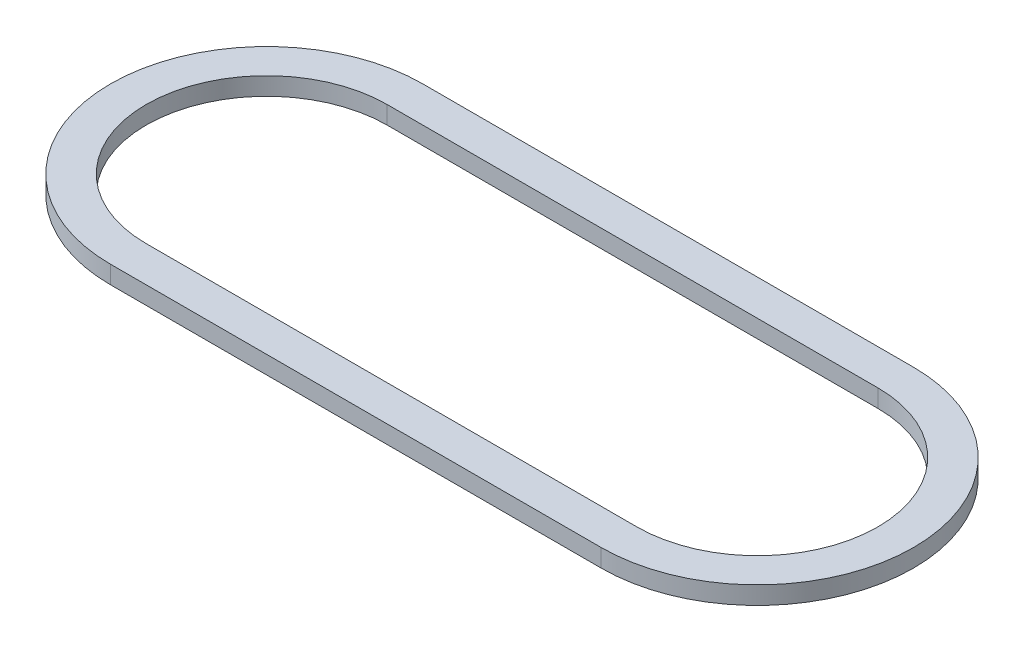
ISO-10303-21;
HEADER;
FILE_DESCRIPTION(('STEP AP214'),'2;1');
FILE_NAME('part.step','',(''),(''),'','','');
FILE_SCHEMA(('AUTOMOTIVE_DESIGN { 1 0 10303 214 1 1 1 1 }'));
ENDSEC;
DATA;
#1=APPLICATION_CONTEXT('core data for automotive mechanical design processes');
#2=APPLICATION_PROTOCOL_DEFINITION('international standard','automotive_design',2000,#1);
#3=PRODUCT_CONTEXT('',#1,'mechanical');
#4=PRODUCT('Part','Part','',(#3));
#5=PRODUCT_RELATED_PRODUCT_CATEGORY('part','',(#4));
#6=PRODUCT_DEFINITION_FORMATION('','',#4);
#7=PRODUCT_DEFINITION_CONTEXT('part definition',#1,'design');
#8=PRODUCT_DEFINITION('design','',#6,#7);
#9=PRODUCT_DEFINITION_SHAPE('','',#8);
#10=(LENGTH_UNIT() NAMED_UNIT(*) SI_UNIT(.MILLI.,.METRE.));
#11=(NAMED_UNIT(*) PLANE_ANGLE_UNIT() SI_UNIT($,.RADIAN.));
#12=(NAMED_UNIT(*) SI_UNIT($,.STERADIAN.) SOLID_ANGLE_UNIT());
#13=UNCERTAINTY_MEASURE_WITH_UNIT(LENGTH_MEASURE(1.E-05),#10,'distance_accuracy_value','');
#14=(GEOMETRIC_REPRESENTATION_CONTEXT(3) GLOBAL_UNCERTAINTY_ASSIGNED_CONTEXT((#13)) GLOBAL_UNIT_ASSIGNED_CONTEXT((#10,
#11,#12)) REPRESENTATION_CONTEXT('',''));
#15=CARTESIAN_POINT('',(0.,0.,0.));
#16=DIRECTION('',(0.,0.,1.));
#17=DIRECTION('',(1.,0.,0.));
#18=AXIS2_PLACEMENT_3D('',#15,#16,#17);
#19=CARTESIAN_POINT('',(-6.985,0.508,0.));
#20=DIRECTION('',(0.,1.,0.));
#21=DIRECTION('',(0.,0.,1.));
#22=AXIS2_PLACEMENT_3D('',#19,#20,#21);
#23=PLANE('',#22);
#24=CARTESIAN_POINT('',(-6.985,0.508,0.));
#25=DIRECTION('',(0.,1.,0.));
#26=DIRECTION('',(0.,0.,1.));
#27=AXIS2_PLACEMENT_3D('',#24,#25,#26);
#28=CIRCLE('',#27,4.445);
#29=CARTESIAN_POINT('',(-6.985,0.508,-4.445));
#30=VERTEX_POINT('',#29);
#31=CARTESIAN_POINT('',(-6.985,0.508,4.445));
#32=VERTEX_POINT('',#31);
#33=EDGE_CURVE('E133',#30,#32,#28,.T.);
#34=ORIENTED_EDGE('',*,*,#33,.T.);
#35=DIRECTION('',(1.,0.,0.));
#36=VECTOR('',#35,1.);
#37=CARTESIAN_POINT('',(-6.985,0.508,4.445));
#38=LINE('',#37,#36);
#39=CARTESIAN_POINT('',(6.985,0.508,4.445));
#40=VERTEX_POINT('',#39);
#41=EDGE_CURVE('E136',#32,#40,#38,.T.);
#42=ORIENTED_EDGE('',*,*,#41,.T.);
#43=CARTESIAN_POINT('',(6.985,0.508,0.));
#44=DIRECTION('',(0.,1.,0.));
#45=DIRECTION('',(0.,0.,1.));
#46=AXIS2_PLACEMENT_3D('',#43,#44,#45);
#47=CIRCLE('',#46,4.445);
#48=CARTESIAN_POINT('',(6.985,0.508,-4.445));
#49=VERTEX_POINT('',#48);
#50=EDGE_CURVE('E139',#40,#49,#47,.T.);
#51=ORIENTED_EDGE('',*,*,#50,.T.);
#52=DIRECTION('',(-1.,0.,0.));
#53=VECTOR('',#52,1.);
#54=CARTESIAN_POINT('',(-6.985,0.508,-4.445));
#55=LINE('',#54,#53);
#56=EDGE_CURVE('E141',#49,#30,#55,.T.);
#57=ORIENTED_EDGE('',*,*,#56,.T.);
#58=EDGE_LOOP('',(#34,#42,#51,#57));
#59=FACE_BOUND('',#58,.T.);
#60=DIRECTION('',(1.,0.,0.));
#61=VECTOR('',#60,1.);
#62=CARTESIAN_POINT('',(-6.985,0.508,3.429));
#63=LINE('',#62,#61);
#64=CARTESIAN_POINT('',(-6.985,0.508,3.429));
#65=VERTEX_POINT('',#64);
#66=CARTESIAN_POINT('',(6.985,0.508,3.429));
#67=VERTEX_POINT('',#66);
#68=EDGE_CURVE('E105',#65,#67,#63,.T.);
#69=ORIENTED_EDGE('',*,*,#68,.F.);
#70=CARTESIAN_POINT('',(-6.985,0.508,0.));
#71=DIRECTION('',(0.,1.,0.));
#72=DIRECTION('',(0.,0.,1.));
#73=AXIS2_PLACEMENT_3D('',#70,#71,#72);
#74=CIRCLE('',#73,3.429);
#75=CARTESIAN_POINT('',(-6.985,0.508,-3.429));
#76=VERTEX_POINT('',#75);
#77=EDGE_CURVE('E97',#76,#65,#74,.T.);
#78=ORIENTED_EDGE('',*,*,#77,.F.);
#79=DIRECTION('',(-1.,0.,0.));
#80=VECTOR('',#79,1.);
#81=CARTESIAN_POINT('',(-6.985,0.508,-3.429));
#82=LINE('',#81,#80);
#83=CARTESIAN_POINT('',(6.985,0.508,-3.429));
#84=VERTEX_POINT('',#83);
#85=EDGE_CURVE('E119',#84,#76,#82,.T.);
#86=ORIENTED_EDGE('',*,*,#85,.F.);
#87=CARTESIAN_POINT('',(6.985,0.508,0.));
#88=DIRECTION('',(0.,1.,0.));
#89=DIRECTION('',(0.,0.,1.));
#90=AXIS2_PLACEMENT_3D('',#87,#88,#89);
#91=CIRCLE('',#90,3.429);
#92=EDGE_CURVE('E117',#67,#84,#91,.T.);
#93=ORIENTED_EDGE('',*,*,#92,.F.);
#94=EDGE_LOOP('',(#69,#78,#86,#93));
#95=FACE_BOUND('',#94,.T.);
#96=ADVANCED_FACE('F32',(#59,#95),#23,.T.);
#97=CARTESIAN_POINT('',(-6.985,0.,0.));
#98=DIRECTION('',(0.,1.,0.));
#99=DIRECTION('',(0.,0.,1.));
#100=AXIS2_PLACEMENT_3D('',#97,#98,#99);
#101=PLANE('',#100);
#102=CARTESIAN_POINT('',(-6.985,0.,0.));
#103=DIRECTION('',(0.,1.,0.));
#104=DIRECTION('',(0.,0.,1.));
#105=AXIS2_PLACEMENT_3D('',#102,#103,#104);
#106=CIRCLE('',#105,4.445);
#107=CARTESIAN_POINT('',(-6.985,0.,-4.445));
#108=VERTEX_POINT('',#107);
#109=CARTESIAN_POINT('',(-6.985,0.,4.445));
#110=VERTEX_POINT('',#109);
#111=EDGE_CURVE('E113',#108,#110,#106,.T.);
#112=ORIENTED_EDGE('',*,*,#111,.F.);
#113=DIRECTION('',(-1.,0.,0.));
#114=VECTOR('',#113,1.);
#115=CARTESIAN_POINT('',(-6.985,0.,-4.445));
#116=LINE('',#115,#114);
#117=CARTESIAN_POINT('',(6.985,0.,-4.445));
#118=VERTEX_POINT('',#117);
#119=EDGE_CURVE('E137',#118,#108,#116,.T.);
#120=ORIENTED_EDGE('',*,*,#119,.F.);
#121=CARTESIAN_POINT('',(6.985,0.,0.));
#122=DIRECTION('',(0.,1.,0.));
#123=DIRECTION('',(0.,0.,1.));
#124=AXIS2_PLACEMENT_3D('',#121,#122,#123);
#125=CIRCLE('',#124,4.445);
#126=CARTESIAN_POINT('',(6.985,0.,4.445));
#127=VERTEX_POINT('',#126);
#128=EDGE_CURVE('E148',#127,#118,#125,.T.);
#129=ORIENTED_EDGE('',*,*,#128,.F.);
#130=DIRECTION('',(1.,0.,0.));
#131=VECTOR('',#130,1.);
#132=CARTESIAN_POINT('',(-6.985,0.,4.445));
#133=LINE('',#132,#131);
#134=EDGE_CURVE('E146',#110,#127,#133,.T.);
#135=ORIENTED_EDGE('',*,*,#134,.F.);
#136=EDGE_LOOP('',(#112,#120,#129,#135));
#137=FACE_BOUND('',#136,.T.);
#138=CARTESIAN_POINT('',(-6.985,0.,0.));
#139=DIRECTION('',(0.,1.,0.));
#140=DIRECTION('',(0.,0.,1.));
#141=AXIS2_PLACEMENT_3D('',#138,#139,#140);
#142=CIRCLE('',#141,3.429);
#143=CARTESIAN_POINT('',(-6.985,0.,-3.429));
#144=VERTEX_POINT('',#143);
#145=CARTESIAN_POINT('',(-6.985,0.,3.429));
#146=VERTEX_POINT('',#145);
#147=EDGE_CURVE('E55',#144,#146,#142,.T.);
#148=ORIENTED_EDGE('',*,*,#147,.T.);
#149=DIRECTION('',(1.,0.,0.));
#150=VECTOR('',#149,1.);
#151=CARTESIAN_POINT('',(-6.985,0.,3.429));
#152=LINE('',#151,#150);
#153=CARTESIAN_POINT('',(6.985,0.,3.429));
#154=VERTEX_POINT('',#153);
#155=EDGE_CURVE('E112',#146,#154,#152,.T.);
#156=ORIENTED_EDGE('',*,*,#155,.T.);
#157=CARTESIAN_POINT('',(6.985,0.,0.));
#158=DIRECTION('',(0.,1.,0.));
#159=DIRECTION('',(0.,0.,1.));
#160=AXIS2_PLACEMENT_3D('',#157,#158,#159);
#161=CIRCLE('',#160,3.429);
#162=CARTESIAN_POINT('',(6.985,0.,-3.429));
#163=VERTEX_POINT('',#162);
#164=EDGE_CURVE('E125',#154,#163,#161,.T.);
#165=ORIENTED_EDGE('',*,*,#164,.T.);
#166=DIRECTION('',(-1.,0.,0.));
#167=VECTOR('',#166,1.);
#168=CARTESIAN_POINT('',(-6.985,0.,-3.429));
#169=LINE('',#168,#167);
#170=EDGE_CURVE('E106',#163,#144,#169,.T.);
#171=ORIENTED_EDGE('',*,*,#170,.T.);
#172=EDGE_LOOP('',(#148,#156,#165,#171));
#173=FACE_BOUND('',#172,.T.);
#174=ADVANCED_FACE('F166',(#137,#173),#101,.F.);
#175=CARTESIAN_POINT('',(-6.985,0.508,0.));
#176=DIRECTION('',(0.,-1.,0.));
#177=DIRECTION('',(0.,0.,-1.));
#178=AXIS2_PLACEMENT_3D('',#175,#176,#177);
#179=CYLINDRICAL_SURFACE('',#178,4.445);
#180=ORIENTED_EDGE('',*,*,#111,.T.);
#181=DIRECTION('',(0.,-1.,0.));
#182=VECTOR('',#181,1.);
#183=CARTESIAN_POINT('',(-6.985,0.508,4.445));
#184=LINE('',#183,#182);
#185=EDGE_CURVE('E11',#32,#110,#184,.T.);
#186=ORIENTED_EDGE('',*,*,#185,.F.);
#187=ORIENTED_EDGE('',*,*,#33,.F.);
#188=DIRECTION('',(0.,-1.,0.));
#189=VECTOR('',#188,1.);
#190=CARTESIAN_POINT('',(-6.985,0.508,-4.445));
#191=LINE('',#190,#189);
#192=EDGE_CURVE('E143',#30,#108,#191,.T.);
#193=ORIENTED_EDGE('',*,*,#192,.T.);
#194=EDGE_LOOP('',(#180,#186,#187,#193));
#195=FACE_BOUND('',#194,.T.);
#196=ADVANCED_FACE('F34',(#195),#179,.T.);
#197=CARTESIAN_POINT('',(-6.985,0.508,4.445));
#198=DIRECTION('',(0.,0.,-1.));
#199=DIRECTION('',(-1.,0.,0.));
#200=AXIS2_PLACEMENT_3D('',#197,#198,#199);
#201=PLANE('',#200);
#202=ORIENTED_EDGE('',*,*,#134,.T.);
#203=DIRECTION('',(0.,-1.,0.));
#204=VECTOR('',#203,1.);
#205=CARTESIAN_POINT('',(6.985,0.508,4.445));
#206=LINE('',#205,#204);
#207=EDGE_CURVE('E40',#40,#127,#206,.T.);
#208=ORIENTED_EDGE('',*,*,#207,.F.);
#209=ORIENTED_EDGE('',*,*,#41,.F.);
#210=ORIENTED_EDGE('',*,*,#185,.T.);
#211=EDGE_LOOP('',(#202,#208,#209,#210));
#212=FACE_BOUND('',#211,.T.);
#213=ADVANCED_FACE('F176',(#212),#201,.F.);
#214=CARTESIAN_POINT('',(6.985,0.508,0.));
#215=DIRECTION('',(0.,-1.,0.));
#216=DIRECTION('',(0.,0.,-1.));
#217=AXIS2_PLACEMENT_3D('',#214,#215,#216);
#218=CYLINDRICAL_SURFACE('',#217,4.445);
#219=ORIENTED_EDGE('',*,*,#128,.T.);
#220=DIRECTION('',(0.,-1.,0.));
#221=VECTOR('',#220,1.);
#222=CARTESIAN_POINT('',(6.985,0.508,-4.445));
#223=LINE('',#222,#221);
#224=EDGE_CURVE('E153',#49,#118,#223,.T.);
#225=ORIENTED_EDGE('',*,*,#224,.F.);
#226=ORIENTED_EDGE('',*,*,#50,.F.);
#227=ORIENTED_EDGE('',*,*,#207,.T.);
#228=EDGE_LOOP('',(#219,#225,#226,#227));
#229=FACE_BOUND('',#228,.T.);
#230=ADVANCED_FACE('F160',(#229),#218,.T.);
#231=CARTESIAN_POINT('',(-6.985,0.508,-4.445));
#232=DIRECTION('',(0.,0.,1.));
#233=DIRECTION('',(1.,0.,0.));
#234=AXIS2_PLACEMENT_3D('',#231,#232,#233);
#235=PLANE('',#234);
#236=ORIENTED_EDGE('',*,*,#119,.T.);
#237=ORIENTED_EDGE('',*,*,#192,.F.);
#238=ORIENTED_EDGE('',*,*,#56,.F.);
#239=ORIENTED_EDGE('',*,*,#224,.T.);
#240=EDGE_LOOP('',(#236,#237,#238,#239));
#241=FACE_BOUND('',#240,.T.);
#242=ADVANCED_FACE('F170',(#241),#235,.F.);
#243=CARTESIAN_POINT('',(-6.985,0.508,0.));
#244=DIRECTION('',(0.,-1.,0.));
#245=DIRECTION('',(0.,0.,-1.));
#246=AXIS2_PLACEMENT_3D('',#243,#244,#245);
#247=CYLINDRICAL_SURFACE('',#246,3.429);
#248=ORIENTED_EDGE('',*,*,#147,.F.);
#249=DIRECTION('',(0.,-1.,0.));
#250=VECTOR('',#249,1.);
#251=CARTESIAN_POINT('',(-6.985,0.508,-3.429));
#252=LINE('',#251,#250);
#253=EDGE_CURVE('E101',#76,#144,#252,.T.);
#254=ORIENTED_EDGE('',*,*,#253,.F.);
#255=ORIENTED_EDGE('',*,*,#77,.T.);
#256=DIRECTION('',(0.,-1.,0.));
#257=VECTOR('',#256,1.);
#258=CARTESIAN_POINT('',(-6.985,0.508,3.429));
#259=LINE('',#258,#257);
#260=EDGE_CURVE('E100',#65,#146,#259,.T.);
#261=ORIENTED_EDGE('',*,*,#260,.T.);
#262=EDGE_LOOP('',(#248,#254,#255,#261));
#263=FACE_BOUND('',#262,.T.);
#264=ADVANCED_FACE('F99',(#263),#247,.F.);
#265=CARTESIAN_POINT('',(-6.985,0.508,3.429));
#266=DIRECTION('',(0.,0.,-1.));
#267=DIRECTION('',(-1.,0.,0.));
#268=AXIS2_PLACEMENT_3D('',#265,#266,#267);
#269=PLANE('',#268);
#270=ORIENTED_EDGE('',*,*,#155,.F.);
#271=ORIENTED_EDGE('',*,*,#260,.F.);
#272=ORIENTED_EDGE('',*,*,#68,.T.);
#273=DIRECTION('',(0.,-1.,0.));
#274=VECTOR('',#273,1.);
#275=CARTESIAN_POINT('',(6.985,0.508,3.429));
#276=LINE('',#275,#274);
#277=EDGE_CURVE('E114',#67,#154,#276,.T.);
#278=ORIENTED_EDGE('',*,*,#277,.T.);
#279=EDGE_LOOP('',(#270,#271,#272,#278));
#280=FACE_BOUND('',#279,.T.);
#281=ADVANCED_FACE('F109',(#280),#269,.T.);
#282=CARTESIAN_POINT('',(6.985,0.508,0.));
#283=DIRECTION('',(0.,-1.,0.));
#284=DIRECTION('',(0.,0.,-1.));
#285=AXIS2_PLACEMENT_3D('',#282,#283,#284);
#286=CYLINDRICAL_SURFACE('',#285,3.429);
#287=ORIENTED_EDGE('',*,*,#164,.F.);
#288=ORIENTED_EDGE('',*,*,#277,.F.);
#289=ORIENTED_EDGE('',*,*,#92,.T.);
#290=DIRECTION('',(0.,-1.,0.));
#291=VECTOR('',#290,1.);
#292=CARTESIAN_POINT('',(6.985,0.508,-3.429));
#293=LINE('',#292,#291);
#294=EDGE_CURVE('E47',#84,#163,#293,.T.);
#295=ORIENTED_EDGE('',*,*,#294,.T.);
#296=EDGE_LOOP('',(#287,#288,#289,#295));
#297=FACE_BOUND('',#296,.T.);
#298=ADVANCED_FACE('F199',(#297),#286,.F.);
#299=CARTESIAN_POINT('',(-6.985,0.508,-3.429));
#300=DIRECTION('',(0.,0.,1.));
#301=DIRECTION('',(1.,0.,0.));
#302=AXIS2_PLACEMENT_3D('',#299,#300,#301);
#303=PLANE('',#302);
#304=ORIENTED_EDGE('',*,*,#170,.F.);
#305=ORIENTED_EDGE('',*,*,#294,.F.);
#306=ORIENTED_EDGE('',*,*,#85,.T.);
#307=ORIENTED_EDGE('',*,*,#253,.T.);
#308=EDGE_LOOP('',(#304,#305,#306,#307));
#309=FACE_BOUND('',#308,.T.);
#310=ADVANCED_FACE('F203',(#309),#303,.T.);
#311=CLOSED_SHELL('',(#96,#174,#196,#213,#230,#242,#264,#281,#298,#310));
#312=MANIFOLD_SOLID_BREP('B2',#311);
#313=ADVANCED_BREP_SHAPE_REPRESENTATION('',(#18,#312),#14);
#314=SHAPE_DEFINITION_REPRESENTATION(#9,#313);
ENDSEC;
END-ISO-10303-21;
